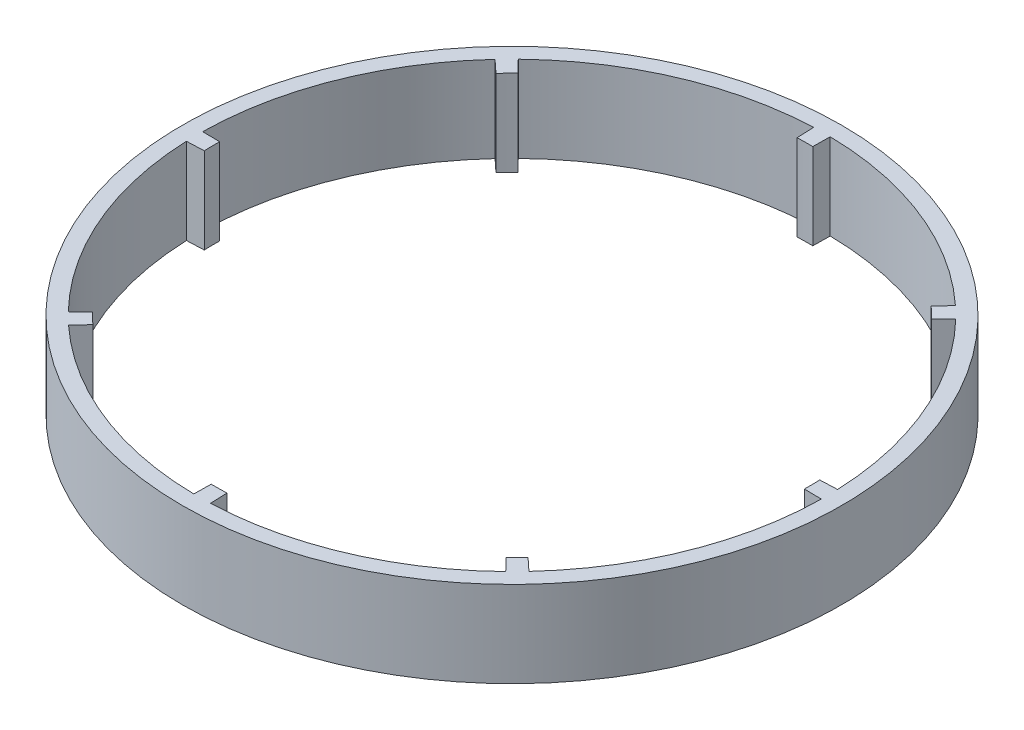
ISO-10303-21;
HEADER;
FILE_DESCRIPTION(('STEP AP214'),'2;1');
FILE_NAME('part.step','',(''),(''),'','','');
FILE_SCHEMA(('AUTOMOTIVE_DESIGN { 1 0 10303 214 1 1 1 1 }'));
ENDSEC;
DATA;
#1=APPLICATION_CONTEXT('core data for automotive mechanical design processes');
#2=APPLICATION_PROTOCOL_DEFINITION('international standard','automotive_design',2000,#1);
#3=PRODUCT_CONTEXT('',#1,'mechanical');
#4=PRODUCT('Part','Part','',(#3));
#5=PRODUCT_RELATED_PRODUCT_CATEGORY('part','',(#4));
#6=PRODUCT_DEFINITION_FORMATION('','',#4);
#7=PRODUCT_DEFINITION_CONTEXT('part definition',#1,'design');
#8=PRODUCT_DEFINITION('design','',#6,#7);
#9=PRODUCT_DEFINITION_SHAPE('','',#8);
#10=(LENGTH_UNIT() NAMED_UNIT(*) SI_UNIT(.MILLI.,.METRE.));
#11=(NAMED_UNIT(*) PLANE_ANGLE_UNIT() SI_UNIT($,.RADIAN.));
#12=(NAMED_UNIT(*) SI_UNIT($,.STERADIAN.) SOLID_ANGLE_UNIT());
#13=UNCERTAINTY_MEASURE_WITH_UNIT(LENGTH_MEASURE(1.E-05),#10,'distance_accuracy_value','');
#14=(GEOMETRIC_REPRESENTATION_CONTEXT(3) GLOBAL_UNCERTAINTY_ASSIGNED_CONTEXT((#13)) GLOBAL_UNIT_ASSIGNED_CONTEXT((#10,
#11,#12)) REPRESENTATION_CONTEXT('',''));
#15=CARTESIAN_POINT('',(0.,0.,0.));
#16=DIRECTION('',(0.,0.,1.));
#17=DIRECTION('',(1.,0.,0.));
#18=AXIS2_PLACEMENT_3D('',#15,#16,#17);
#19=CARTESIAN_POINT('',(0.,30.,0.));
#20=DIRECTION('',(0.,-1.,0.));
#21=DIRECTION('',(0.,0.,-1.));
#22=AXIS2_PLACEMENT_3D('',#19,#20,#21);
#23=CYLINDRICAL_SURFACE('',#22,103.5);
#24=CARTESIAN_POINT('',(0.,0.,0.));
#25=DIRECTION('',(0.,1.,0.));
#26=DIRECTION('',(0.,0.,1.));
#27=AXIS2_PLACEMENT_3D('',#24,#25,#26);
#28=CIRCLE('',#27,103.5);
#29=CARTESIAN_POINT('',(72.1436056941333,0.,74.2128705646769));
#30=VERTEX_POINT('',#29);
#31=CARTESIAN_POINT('',(75.9287369363859,0.,70.3354598139883));
#32=VERTEX_POINT('',#31);
#33=EDGE_CURVE('E296',#30,#32,#28,.T.);
#34=ORIENTED_EDGE('',*,*,#33,.F.);
#35=DIRECTION('',(0.,-1.,0.));
#36=VECTOR('',#35,1.);
#37=CARTESIAN_POINT('',(72.1436056941333,30.,74.2128705646769));
#38=LINE('',#37,#36);
#39=CARTESIAN_POINT('',(72.1436056941333,30.,74.2128705646769));
#40=VERTEX_POINT('',#39);
#41=EDGE_CURVE('E11',#40,#30,#38,.T.);
#42=ORIENTED_EDGE('',*,*,#41,.F.);
#43=CARTESIAN_POINT('',(0.,30.,0.));
#44=DIRECTION('',(0.,1.,0.));
#45=DIRECTION('',(0.,0.,1.));
#46=AXIS2_PLACEMENT_3D('',#43,#44,#45);
#47=CIRCLE('',#46,103.5);
#48=CARTESIAN_POINT('',(75.9287369363859,30.,70.3354598139883));
#49=VERTEX_POINT('',#48);
#50=EDGE_CURVE('E403',#40,#49,#47,.T.);
#51=ORIENTED_EDGE('',*,*,#50,.T.);
#52=DIRECTION('',(0.,-1.,0.));
#53=VECTOR('',#52,1.);
#54=CARTESIAN_POINT('',(75.9287369363859,30.,70.3354598139883));
#55=LINE('',#54,#53);
#56=EDGE_CURVE('E65',#49,#32,#55,.T.);
#57=ORIENTED_EDGE('',*,*,#56,.T.);
#58=EDGE_LOOP('',(#34,#42,#51,#57));
#59=FACE_BOUND('',#58,.T.);
#60=ADVANCED_FACE('F47',(#59),#23,.F.);
#61=CARTESIAN_POINT('',(6.25906942823322E-12,30.,-6.08454885799164E-12));
#62=DIRECTION('',(0.717032565842345,0.,-0.697039668542288));
#63=DIRECTION('',(-0.697039668542288,0.,-0.717032565842345));
#64=AXIS2_PLACEMENT_3D('',#61,#62,#63);
#65=PLANE('',#64);
#66=DIRECTION('',(0.697039668542288,0.,0.717032565842345));
#67=VECTOR('',#66,1.);
#68=CARTESIAN_POINT('',(6.25906942823322E-12,0.,-6.08454885799164E-12));
#69=LINE('',#68,#67);
#70=CARTESIAN_POINT('',(76.325843705387,0.,78.515065959731));
#71=VERTEX_POINT('',#70);
#72=EDGE_CURVE('E299',#30,#71,#69,.T.);
#73=ORIENTED_EDGE('',*,*,#72,.T.);
#74=DIRECTION('',(0.,-1.,0.));
#75=VECTOR('',#74,1.);
#76=CARTESIAN_POINT('',(76.325843705387,30.,78.515065959731));
#77=LINE('',#76,#75);
#78=CARTESIAN_POINT('',(76.325843705387,30.,78.515065959731));
#79=VERTEX_POINT('',#78);
#80=EDGE_CURVE('E57',#79,#71,#77,.T.);
#81=ORIENTED_EDGE('',*,*,#80,.F.);
#82=DIRECTION('',(0.697039668542288,0.,0.717032565842345));
#83=VECTOR('',#82,1.);
#84=CARTESIAN_POINT('',(6.25906942823322E-12,30.,-6.08454885799164E-12));
#85=LINE('',#84,#83);
#86=EDGE_CURVE('E511',#40,#79,#85,.T.);
#87=ORIENTED_EDGE('',*,*,#86,.F.);
#88=ORIENTED_EDGE('',*,*,#41,.T.);
#89=EDGE_LOOP('',(#73,#81,#87,#88));
#90=FACE_BOUND('',#89,.T.);
#91=ADVANCED_FACE('F49',(#90),#65,.F.);
#92=CARTESIAN_POINT('',(0.,30.,0.));
#93=DIRECTION('',(0.,-1.,0.));
#94=DIRECTION('',(0.,0.,-1.));
#95=AXIS2_PLACEMENT_3D('',#92,#93,#94);
#96=CYLINDRICAL_SURFACE('',#95,109.5);
#97=CARTESIAN_POINT('',(0.,0.,0.));
#98=DIRECTION('',(0.,1.,0.));
#99=DIRECTION('',(0.,0.,1.));
#100=AXIS2_PLACEMENT_3D('',#97,#98,#99);
#101=CIRCLE('',#100,109.5);
#102=CARTESIAN_POINT('',(4.18432210591433,0.,109.420023069427));
#103=VERTEX_POINT('',#102);
#104=EDGE_CURVE('E305',#103,#71,#101,.T.);
#105=ORIENTED_EDGE('',*,*,#104,.F.);
#106=DIRECTION('',(0.,-1.,0.));
#107=VECTOR('',#106,1.);
#108=CARTESIAN_POINT('',(4.18432210591433,30.,109.420023069427));
#109=LINE('',#108,#107);
#110=CARTESIAN_POINT('',(4.18432210591433,30.,109.420023069427));
#111=VERTEX_POINT('',#110);
#112=EDGE_CURVE('E485',#111,#103,#109,.T.);
#113=ORIENTED_EDGE('',*,*,#112,.F.);
#114=CARTESIAN_POINT('',(0.,30.,0.));
#115=DIRECTION('',(0.,1.,0.));
#116=DIRECTION('',(0.,0.,1.));
#117=AXIS2_PLACEMENT_3D('',#114,#115,#116);
#118=CIRCLE('',#117,109.5);
#119=EDGE_CURVE('E494',#111,#79,#118,.T.);
#120=ORIENTED_EDGE('',*,*,#119,.T.);
#121=ORIENTED_EDGE('',*,*,#80,.T.);
#122=EDGE_LOOP('',(#105,#113,#120,#121));
#123=FACE_BOUND('',#122,.T.);
#124=ADVANCED_FACE('F492',(#123),#96,.F.);
#125=CARTESIAN_POINT('',(8.88396437577493E-12,30.,-3.39730951272463E-13));
#126=DIRECTION('',(0.999269617072397,0.,-0.0382129872685428));
#127=DIRECTION('',(-0.0382129872685428,0.,-0.999269617072397));
#128=AXIS2_PLACEMENT_3D('',#125,#126,#127);
#129=PLANE('',#128);
#130=DIRECTION('',(0.0382129872685428,0.,0.999269617072397));
#131=VECTOR('',#130,1.);
#132=CARTESIAN_POINT('',(8.88396437577493E-12,0.,-3.39730951272463E-13));
#133=LINE('',#132,#131);
#134=CARTESIAN_POINT('',(3.95504418230307,0.,103.424405366993));
#135=VERTEX_POINT('',#134);
#136=EDGE_CURVE('E309',#135,#103,#133,.T.);
#137=ORIENTED_EDGE('',*,*,#136,.F.);
#138=DIRECTION('',(0.,-1.,0.));
#139=VECTOR('',#138,1.);
#140=CARTESIAN_POINT('',(3.95504418230307,30.,103.424405366993));
#141=LINE('',#140,#139);
#142=CARTESIAN_POINT('',(3.95504418230307,30.,103.424405366993));
#143=VERTEX_POINT('',#142);
#144=EDGE_CURVE('E482',#143,#135,#141,.T.);
#145=ORIENTED_EDGE('',*,*,#144,.F.);
#146=DIRECTION('',(0.0382129872685428,0.,0.999269617072397));
#147=VECTOR('',#146,1.);
#148=CARTESIAN_POINT('',(8.88396437577493E-12,30.,-3.39730951272463E-13));
#149=LINE('',#148,#147);
#150=EDGE_CURVE('E508',#143,#111,#149,.T.);
#151=ORIENTED_EDGE('',*,*,#150,.T.);
#152=ORIENTED_EDGE('',*,*,#112,.T.);
#153=EDGE_LOOP('',(#137,#145,#151,#152));
#154=FACE_BOUND('',#153,.T.);
#155=ADVANCED_FACE('F505',(#154),#129,.T.);
#156=CARTESIAN_POINT('',(-1.46319122203231,0.,103.489656833173));
#157=VERTEX_POINT('',#156);
#158=EDGE_CURVE('E301',#157,#135,#28,.T.);
#159=ORIENTED_EDGE('',*,*,#158,.F.);
#160=DIRECTION('',(0.,-1.,0.));
#161=VECTOR('',#160,1.);
#162=CARTESIAN_POINT('',(-1.46319122203231,30.,103.489656833173));
#163=LINE('',#162,#161);
#164=CARTESIAN_POINT('',(-1.46319122203231,30.,103.489656833173));
#165=VERTEX_POINT('',#164);
#166=EDGE_CURVE('E479',#165,#157,#163,.T.);
#167=ORIENTED_EDGE('',*,*,#166,.F.);
#168=EDGE_CURVE('E516',#165,#143,#47,.T.);
#169=ORIENTED_EDGE('',*,*,#168,.T.);
#170=ORIENTED_EDGE('',*,*,#144,.T.);
#171=EDGE_LOOP('',(#159,#167,#169,#170));
#172=FACE_BOUND('',#171,.T.);
#173=ADVANCED_FACE('F670',(#172),#23,.F.);
#174=CARTESIAN_POINT('',(8.90409621279607E-12,30.,1.25890797374811E-13));
#175=DIRECTION('',(0.999900066020987,0.,0.0141371132564369));
#176=DIRECTION('',(0.0141371132564369,0.,-0.999900066020987));
#177=AXIS2_PLACEMENT_3D('',#174,#175,#176);
#178=PLANE('',#177);
#179=DIRECTION('',(-0.0141371132564369,0.,0.999900066020987));
#180=VECTOR('',#179,1.);
#181=CARTESIAN_POINT('',(8.90409621279607E-12,0.,1.25890797374811E-13));
#182=LINE('',#181,#180);
#183=CARTESIAN_POINT('',(-1.54801390157094,0.,109.489057229299));
#184=VERTEX_POINT('',#183);
#185=EDGE_CURVE('E313',#157,#184,#182,.T.);
#186=ORIENTED_EDGE('',*,*,#185,.T.);
#187=DIRECTION('',(0.,-1.,0.));
#188=VECTOR('',#187,1.);
#189=CARTESIAN_POINT('',(-1.54801390157094,30.,109.489057229299));
#190=LINE('',#189,#188);
#191=CARTESIAN_POINT('',(-1.54801390157094,30.,109.489057229299));
#192=VERTEX_POINT('',#191);
#193=EDGE_CURVE('E476',#192,#184,#190,.T.);
#194=ORIENTED_EDGE('',*,*,#193,.F.);
#195=DIRECTION('',(-0.0141371132564369,0.,0.999900066020987));
#196=VECTOR('',#195,1.);
#197=CARTESIAN_POINT('',(8.90409621279607E-12,30.,1.25890797374811E-13));
#198=LINE('',#197,#196);
#199=EDGE_CURVE('E521',#165,#192,#198,.T.);
#200=ORIENTED_EDGE('',*,*,#199,.F.);
#201=ORIENTED_EDGE('',*,*,#166,.T.);
#202=EDGE_LOOP('',(#186,#194,#200,#201));
#203=FACE_BOUND('',#202,.T.);
#204=ADVANCED_FACE('F677',(#203),#178,.F.);
#205=CARTESIAN_POINT('',(0.,30.,0.));
#206=DIRECTION('',(0.,-1.,0.));
#207=DIRECTION('',(0.,0.,-1.));
#208=AXIS2_PLACEMENT_3D('',#205,#206,#207);
#209=CYLINDRICAL_SURFACE('',#208,109.5);
#210=CARTESIAN_POINT('',(0.,0.,0.));
#211=DIRECTION('',(0.,1.,0.));
#212=DIRECTION('',(0.,0.,1.));
#213=AXIS2_PLACEMENT_3D('',#210,#211,#212);
#214=CIRCLE('',#213,109.5);
#215=CARTESIAN_POINT('',(-74.4128777742197,0.,80.3304028457414));
#216=VERTEX_POINT('',#215);
#217=EDGE_CURVE('E317',#216,#184,#214,.T.);
#218=ORIENTED_EDGE('',*,*,#217,.F.);
#219=DIRECTION('',(0.,-1.,0.));
#220=VECTOR('',#219,1.);
#221=CARTESIAN_POINT('',(-74.4128777742197,30.,80.3304028457414));
#222=LINE('',#221,#220);
#223=CARTESIAN_POINT('',(-74.4128777742197,30.,80.3304028457414));
#224=VERTEX_POINT('',#223);
#225=EDGE_CURVE('E473',#224,#216,#222,.T.);
#226=ORIENTED_EDGE('',*,*,#225,.F.);
#227=CARTESIAN_POINT('',(0.,30.,0.));
#228=DIRECTION('',(0.,1.,0.));
#229=DIRECTION('',(0.,0.,1.));
#230=AXIS2_PLACEMENT_3D('',#227,#228,#229);
#231=CIRCLE('',#230,109.5);
#232=EDGE_CURVE('E524',#224,#192,#231,.T.);
#233=ORIENTED_EDGE('',*,*,#232,.T.);
#234=ORIENTED_EDGE('',*,*,#193,.T.);
#235=EDGE_LOOP('',(#218,#226,#233,#234));
#236=FACE_BOUND('',#235,.T.);
#237=ADVANCED_FACE('F895',(#236),#209,.F.);
#238=CARTESIAN_POINT('',(6.4903222084107E-12,30.,6.01221375843568E-12));
#239=DIRECTION('',(0.733610984892559,0.,0.679569660038594));
#240=DIRECTION('',(0.679569660038594,0.,-0.733610984892559));
#241=AXIS2_PLACEMENT_3D('',#238,#239,#240);
#242=PLANE('',#241);
#243=DIRECTION('',(-0.679569660038594,0.,0.733610984892559));
#244=VECTOR('',#243,1.);
#245=CARTESIAN_POINT('',(6.4903222084107E-12,0.,6.01221375843568E-12));
#246=LINE('',#245,#244);
#247=CARTESIAN_POINT('',(-70.3354598139881,0.,75.928736936386));
#248=VERTEX_POINT('',#247);
#249=EDGE_CURVE('E321',#248,#216,#246,.T.);
#250=ORIENTED_EDGE('',*,*,#249,.F.);
#251=DIRECTION('',(0.,-1.,0.));
#252=VECTOR('',#251,1.);
#253=CARTESIAN_POINT('',(-70.3354598139881,30.,75.928736936386));
#254=LINE('',#253,#252);
#255=CARTESIAN_POINT('',(-70.3354598139881,30.,75.928736936386));
#256=VERTEX_POINT('',#255);
#257=EDGE_CURVE('E470',#256,#248,#254,.T.);
#258=ORIENTED_EDGE('',*,*,#257,.F.);
#259=DIRECTION('',(-0.679569660038594,0.,0.733610984892559));
#260=VECTOR('',#259,1.);
#261=CARTESIAN_POINT('',(6.4903222084107E-12,30.,6.01221375843568E-12));
#262=LINE('',#261,#260);
#263=EDGE_CURVE('E528',#256,#224,#262,.T.);
#264=ORIENTED_EDGE('',*,*,#263,.T.);
#265=ORIENTED_EDGE('',*,*,#225,.T.);
#266=EDGE_LOOP('',(#250,#258,#264,#265));
#267=FACE_BOUND('',#266,.T.);
#268=ADVANCED_FACE('F888',(#267),#242,.T.);
#269=CARTESIAN_POINT('',(-74.2128705646766,0.,72.1436056941334));
#270=VERTEX_POINT('',#269);
#271=EDGE_CURVE('E325',#270,#248,#28,.T.);
#272=ORIENTED_EDGE('',*,*,#271,.F.);
#273=DIRECTION('',(0.,-1.,0.));
#274=VECTOR('',#273,1.);
#275=CARTESIAN_POINT('',(-74.2128705646766,30.,72.1436056941334));
#276=LINE('',#275,#274);
#277=CARTESIAN_POINT('',(-74.2128705646766,30.,72.1436056941334));
#278=VERTEX_POINT('',#277);
#279=EDGE_CURVE('E467',#278,#270,#276,.T.);
#280=ORIENTED_EDGE('',*,*,#279,.F.);
#281=EDGE_CURVE('E532',#278,#256,#47,.T.);
#282=ORIENTED_EDGE('',*,*,#281,.T.);
#283=ORIENTED_EDGE('',*,*,#257,.T.);
#284=EDGE_LOOP('',(#272,#280,#282,#283));
#285=FACE_BOUND('',#284,.T.);
#286=ADVANCED_FACE('F678',(#285),#23,.F.);
#287=CARTESIAN_POINT('',(6.48599365545847E-12,30.,6.67202869893543E-12));
#288=DIRECTION('',(0.697039668542286,0.,0.717032565842347));
#289=DIRECTION('',(0.717032565842347,0.,-0.697039668542286));
#290=AXIS2_PLACEMENT_3D('',#287,#288,#289);
#291=PLANE('',#290);
#292=DIRECTION('',(-0.717032565842347,0.,0.697039668542286));
#293=VECTOR('',#292,1.);
#294=CARTESIAN_POINT('',(6.48599365545847E-12,0.,6.67202869893543E-12));
#295=LINE('',#294,#293);
#296=CARTESIAN_POINT('',(-78.5150659597307,0.,76.3258437053871));
#297=VERTEX_POINT('',#296);
#298=EDGE_CURVE('E326',#270,#297,#295,.T.);
#299=ORIENTED_EDGE('',*,*,#298,.T.);
#300=DIRECTION('',(0.,-1.,0.));
#301=VECTOR('',#300,1.);
#302=CARTESIAN_POINT('',(-78.5150659597307,30.,76.3258437053871));
#303=LINE('',#302,#301);
#304=CARTESIAN_POINT('',(-78.5150659597307,30.,76.3258437053871));
#305=VERTEX_POINT('',#304);
#306=EDGE_CURVE('E464',#305,#297,#303,.T.);
#307=ORIENTED_EDGE('',*,*,#306,.F.);
#308=DIRECTION('',(-0.717032565842347,0.,0.697039668542286));
#309=VECTOR('',#308,1.);
#310=CARTESIAN_POINT('',(6.48599365545847E-12,30.,6.67202869893543E-12));
#311=LINE('',#310,#309);
#312=EDGE_CURVE('E533',#278,#305,#311,.T.);
#313=ORIENTED_EDGE('',*,*,#312,.F.);
#314=ORIENTED_EDGE('',*,*,#279,.T.);
#315=EDGE_LOOP('',(#299,#307,#313,#314));
#316=FACE_BOUND('',#315,.T.);
#317=ADVANCED_FACE('F871',(#316),#291,.F.);
#318=CARTESIAN_POINT('',(0.,30.,0.));
#319=DIRECTION('',(0.,-1.,0.));
#320=DIRECTION('',(0.,0.,-1.));
#321=AXIS2_PLACEMENT_3D('',#318,#319,#320);
#322=CYLINDRICAL_SURFACE('',#321,109.5);
#323=CARTESIAN_POINT('',(0.,0.,0.));
#324=DIRECTION('',(0.,1.,0.));
#325=DIRECTION('',(0.,0.,1.));
#326=AXIS2_PLACEMENT_3D('',#323,#324,#325);
#327=CIRCLE('',#326,109.5);
#328=CARTESIAN_POINT('',(-109.420023069427,0.,4.18432210591443));
#329=VERTEX_POINT('',#328);
#330=EDGE_CURVE('E330',#329,#297,#327,.T.);
#331=ORIENTED_EDGE('',*,*,#330,.F.);
#332=DIRECTION('',(0.,-1.,0.));
#333=VECTOR('',#332,1.);
#334=CARTESIAN_POINT('',(-109.420023069427,30.,4.18432210591443));
#335=LINE('',#334,#333);
#336=CARTESIAN_POINT('',(-109.420023069427,30.,4.18432210591443));
#337=VERTEX_POINT('',#336);
#338=EDGE_CURVE('E461',#337,#329,#335,.T.);
#339=ORIENTED_EDGE('',*,*,#338,.F.);
#340=CARTESIAN_POINT('',(0.,30.,0.));
#341=DIRECTION('',(0.,1.,0.));
#342=DIRECTION('',(0.,0.,1.));
#343=AXIS2_PLACEMENT_3D('',#340,#341,#342);
#344=CIRCLE('',#343,109.5);
#345=EDGE_CURVE('E536',#337,#305,#344,.T.);
#346=ORIENTED_EDGE('',*,*,#345,.T.);
#347=ORIENTED_EDGE('',*,*,#306,.T.);
#348=EDGE_LOOP('',(#331,#339,#346,#347));
#349=FACE_BOUND('',#348,.T.);
#350=ADVANCED_FACE('F862',(#349),#322,.F.);
#351=CARTESIAN_POINT('',(3.43277410958918E-13,30.,8.97670429657571E-12));
#352=DIRECTION('',(0.0382129872685429,0.,0.999269617072397));
#353=DIRECTION('',(0.999269617072397,0.,-0.0382129872685429));
#354=AXIS2_PLACEMENT_3D('',#351,#352,#353);
#355=PLANE('',#354);
#356=DIRECTION('',(-0.999269617072397,0.,0.0382129872685429));
#357=VECTOR('',#356,1.);
#358=CARTESIAN_POINT('',(3.43277410958918E-13,0.,8.97670429657571E-12));
#359=LINE('',#358,#357);
#360=CARTESIAN_POINT('',(-103.424405366993,0.,3.95504418230317));
#361=VERTEX_POINT('',#360);
#362=EDGE_CURVE('E334',#361,#329,#359,.T.);
#363=ORIENTED_EDGE('',*,*,#362,.F.);
#364=DIRECTION('',(0.,-1.,0.));
#365=VECTOR('',#364,1.);
#366=CARTESIAN_POINT('',(-103.424405366993,30.,3.95504418230317));
#367=LINE('',#366,#365);
#368=CARTESIAN_POINT('',(-103.424405366993,30.,3.95504418230317));
#369=VERTEX_POINT('',#368);
#370=EDGE_CURVE('E458',#369,#361,#367,.T.);
#371=ORIENTED_EDGE('',*,*,#370,.F.);
#372=DIRECTION('',(-0.999269617072397,0.,0.0382129872685429));
#373=VECTOR('',#372,1.);
#374=CARTESIAN_POINT('',(3.43277410958918E-13,30.,8.97670429657571E-12));
#375=LINE('',#374,#373);
#376=EDGE_CURVE('E540',#369,#337,#375,.T.);
#377=ORIENTED_EDGE('',*,*,#376,.T.);
#378=ORIENTED_EDGE('',*,*,#338,.T.);
#379=EDGE_LOOP('',(#363,#371,#377,#378));
#380=FACE_BOUND('',#379,.T.);
#381=ADVANCED_FACE('F855',(#380),#355,.T.);
#382=CARTESIAN_POINT('',(-103.489656833172,0.,-1.46319122203222));
#383=VERTEX_POINT('',#382);
#384=EDGE_CURVE('E338',#383,#361,#28,.T.);
#385=ORIENTED_EDGE('',*,*,#384,.F.);
#386=DIRECTION('',(0.,-1.,0.));
#387=VECTOR('',#386,1.);
#388=CARTESIAN_POINT('',(-103.489656833172,30.,-1.46319122203222));
#389=LINE('',#388,#387);
#390=CARTESIAN_POINT('',(-103.489656833172,30.,-1.46319122203222));
#391=VERTEX_POINT('',#390);
#392=EDGE_CURVE('E455',#391,#383,#389,.T.);
#393=ORIENTED_EDGE('',*,*,#392,.F.);
#394=EDGE_CURVE('E544',#391,#369,#47,.T.);
#395=ORIENTED_EDGE('',*,*,#394,.T.);
#396=ORIENTED_EDGE('',*,*,#370,.T.);
#397=EDGE_LOOP('',(#385,#393,#395,#396));
#398=FACE_BOUND('',#397,.T.);
#399=ADVANCED_FACE('F822',(#398),#23,.F.);
#400=CARTESIAN_POINT('',(-1.27141520469483E-13,30.,8.99255826882209E-12));
#401=DIRECTION('',(-0.0141371132564368,0.,0.999900066020987));
#402=DIRECTION('',(0.999900066020987,0.,0.0141371132564368));
#403=AXIS2_PLACEMENT_3D('',#400,#401,#402);
#404=PLANE('',#403);
#405=DIRECTION('',(-0.999900066020987,0.,-0.0141371132564368));
#406=VECTOR('',#405,1.);
#407=CARTESIAN_POINT('',(-1.27141520469483E-13,0.,8.99255826882209E-12));
#408=LINE('',#407,#406);
#409=CARTESIAN_POINT('',(-109.489057229298,0.,-1.54801390157084));
#410=VERTEX_POINT('',#409);
#411=EDGE_CURVE('E339',#383,#410,#408,.T.);
#412=ORIENTED_EDGE('',*,*,#411,.T.);
#413=DIRECTION('',(0.,-1.,0.));
#414=VECTOR('',#413,1.);
#415=CARTESIAN_POINT('',(-109.489057229298,30.,-1.54801390157084));
#416=LINE('',#415,#414);
#417=CARTESIAN_POINT('',(-109.489057229298,30.,-1.54801390157084));
#418=VERTEX_POINT('',#417);
#419=EDGE_CURVE('E452',#418,#410,#416,.T.);
#420=ORIENTED_EDGE('',*,*,#419,.F.);
#421=DIRECTION('',(-0.999900066020987,0.,-0.0141371132564368));
#422=VECTOR('',#421,1.);
#423=CARTESIAN_POINT('',(-1.27141520469483E-13,30.,8.99255826882209E-12));
#424=LINE('',#423,#422);
#425=EDGE_CURVE('E545',#391,#418,#424,.T.);
#426=ORIENTED_EDGE('',*,*,#425,.F.);
#427=ORIENTED_EDGE('',*,*,#392,.T.);
#428=EDGE_LOOP('',(#412,#420,#426,#427));
#429=FACE_BOUND('',#428,.T.);
#430=ADVANCED_FACE('F838',(#429),#404,.F.);
#431=CARTESIAN_POINT('',(0.,30.,0.));
#432=DIRECTION('',(0.,-1.,0.));
#433=DIRECTION('',(0.,0.,-1.));
#434=AXIS2_PLACEMENT_3D('',#431,#432,#433);
#435=CYLINDRICAL_SURFACE('',#434,109.5);
#436=CARTESIAN_POINT('',(0.,0.,0.));
#437=DIRECTION('',(0.,1.,0.));
#438=DIRECTION('',(0.,0.,1.));
#439=AXIS2_PLACEMENT_3D('',#436,#437,#438);
#440=CIRCLE('',#439,109.5);
#441=CARTESIAN_POINT('',(-80.3304028457412,0.,-74.4128777742196));
#442=VERTEX_POINT('',#441);
#443=EDGE_CURVE('E343',#442,#410,#440,.T.);
#444=ORIENTED_EDGE('',*,*,#443,.F.);
#445=DIRECTION('',(0.,-1.,0.));
#446=VECTOR('',#445,1.);
#447=CARTESIAN_POINT('',(-80.3304028457412,30.,-74.4128777742196));
#448=LINE('',#447,#446);
#449=CARTESIAN_POINT('',(-80.3304028457412,30.,-74.4128777742196));
#450=VERTEX_POINT('',#449);
#451=EDGE_CURVE('E449',#450,#442,#448,.T.);
#452=ORIENTED_EDGE('',*,*,#451,.F.);
#453=CARTESIAN_POINT('',(0.,30.,0.));
#454=DIRECTION('',(0.,1.,0.));
#455=DIRECTION('',(0.,0.,1.));
#456=AXIS2_PLACEMENT_3D('',#453,#454,#455);
#457=CIRCLE('',#456,109.5);
#458=EDGE_CURVE('E548',#450,#418,#457,.T.);
#459=ORIENTED_EDGE('',*,*,#458,.T.);
#460=ORIENTED_EDGE('',*,*,#419,.T.);
#461=EDGE_LOOP('',(#444,#452,#459,#460));
#462=FACE_BOUND('',#461,.T.);
#463=ADVANCED_FACE('F829',(#462),#435,.F.);
#464=CARTESIAN_POINT('',(-6.09237660854817E-12,30.,6.57685983785617E-12));
#465=DIRECTION('',(-0.679569660038595,0.,0.733610984892558));
#466=DIRECTION('',(0.733610984892558,0.,0.679569660038595));
#467=AXIS2_PLACEMENT_3D('',#464,#465,#466);
#468=PLANE('',#467);
#469=DIRECTION('',(-0.733610984892558,0.,-0.679569660038595));
#470=VECTOR('',#469,1.);
#471=CARTESIAN_POINT('',(-6.09237660854817E-12,0.,6.57685983785617E-12));
#472=LINE('',#471,#470);
#473=CARTESIAN_POINT('',(-75.9287369363858,0.,-70.335459813988));
#474=VERTEX_POINT('',#473);
#475=EDGE_CURVE('E347',#474,#442,#472,.T.);
#476=ORIENTED_EDGE('',*,*,#475,.F.);
#477=DIRECTION('',(0.,-1.,0.));
#478=VECTOR('',#477,1.);
#479=CARTESIAN_POINT('',(-75.9287369363858,30.,-70.335459813988));
#480=LINE('',#479,#478);
#481=CARTESIAN_POINT('',(-75.9287369363858,30.,-70.335459813988));
#482=VERTEX_POINT('',#481);
#483=EDGE_CURVE('E446',#482,#474,#480,.T.);
#484=ORIENTED_EDGE('',*,*,#483,.F.);
#485=DIRECTION('',(-0.733610984892558,0.,-0.679569660038595));
#486=VECTOR('',#485,1.);
#487=CARTESIAN_POINT('',(-6.09237660854817E-12,30.,6.57685983785617E-12));
#488=LINE('',#487,#486);
#489=EDGE_CURVE('E552',#482,#450,#488,.T.);
#490=ORIENTED_EDGE('',*,*,#489,.T.);
#491=ORIENTED_EDGE('',*,*,#451,.T.);
#492=EDGE_LOOP('',(#476,#484,#490,#491));
#493=FACE_BOUND('',#492,.T.);
#494=ADVANCED_FACE('F821',(#493),#468,.T.);
#495=CARTESIAN_POINT('',(-72.1436056941332,0.,-74.2128705646765));
#496=VERTEX_POINT('',#495);
#497=EDGE_CURVE('E351',#496,#474,#28,.T.);
#498=ORIENTED_EDGE('',*,*,#497,.F.);
#499=DIRECTION('',(0.,-1.,0.));
#500=VECTOR('',#499,1.);
#501=CARTESIAN_POINT('',(-72.1436056941332,30.,-74.2128705646765));
#502=LINE('',#501,#500);
#503=CARTESIAN_POINT('',(-72.1436056941332,30.,-74.2128705646765));
#504=VERTEX_POINT('',#503);
#505=EDGE_CURVE('E443',#504,#496,#502,.T.);
#506=ORIENTED_EDGE('',*,*,#505,.F.);
#507=EDGE_CURVE('E556',#504,#482,#47,.T.);
#508=ORIENTED_EDGE('',*,*,#507,.T.);
#509=ORIENTED_EDGE('',*,*,#483,.T.);
#510=EDGE_LOOP('',(#498,#506,#508,#509));
#511=FACE_BOUND('',#510,.T.);
#512=ADVANCED_FACE('F667',(#511),#23,.F.);
#513=CARTESIAN_POINT('',(-6.48793842163445E-12,30.,6.30703633610578E-12));
#514=DIRECTION('',(-0.717032565842346,0.,0.697039668542287));
#515=DIRECTION('',(0.697039668542287,0.,0.717032565842346));
#516=AXIS2_PLACEMENT_3D('',#513,#514,#515);
#517=PLANE('',#516);
#518=DIRECTION('',(-0.697039668542287,0.,-0.717032565842346));
#519=VECTOR('',#518,1.);
#520=CARTESIAN_POINT('',(-6.48793842163445E-12,0.,6.30703633610578E-12));
#521=LINE('',#520,#519);
#522=CARTESIAN_POINT('',(-76.3258437053869,0.,-78.5150659597306));
#523=VERTEX_POINT('',#522);
#524=EDGE_CURVE('E352',#496,#523,#521,.T.);
#525=ORIENTED_EDGE('',*,*,#524,.T.);
#526=DIRECTION('',(0.,-1.,0.));
#527=VECTOR('',#526,1.);
#528=CARTESIAN_POINT('',(-76.3258437053869,30.,-78.5150659597306));
#529=LINE('',#528,#527);
#530=CARTESIAN_POINT('',(-76.3258437053869,30.,-78.5150659597306));
#531=VERTEX_POINT('',#530);
#532=EDGE_CURVE('E440',#531,#523,#529,.T.);
#533=ORIENTED_EDGE('',*,*,#532,.F.);
#534=DIRECTION('',(-0.697039668542287,0.,-0.717032565842346));
#535=VECTOR('',#534,1.);
#536=CARTESIAN_POINT('',(-6.48793842163445E-12,30.,6.30703633610578E-12));
#537=LINE('',#536,#535);
#538=EDGE_CURVE('E557',#504,#531,#537,.T.);
#539=ORIENTED_EDGE('',*,*,#538,.F.);
#540=ORIENTED_EDGE('',*,*,#505,.T.);
#541=EDGE_LOOP('',(#525,#533,#539,#540));
#542=FACE_BOUND('',#541,.T.);
#543=ADVANCED_FACE('F804',(#542),#517,.F.);
#544=CARTESIAN_POINT('',(0.,30.,0.));
#545=DIRECTION('',(0.,-1.,0.));
#546=DIRECTION('',(0.,0.,-1.));
#547=AXIS2_PLACEMENT_3D('',#544,#545,#546);
#548=CYLINDRICAL_SURFACE('',#547,109.5);
#549=CARTESIAN_POINT('',(0.,0.,0.));
#550=DIRECTION('',(0.,1.,0.));
#551=DIRECTION('',(0.,0.,1.));
#552=AXIS2_PLACEMENT_3D('',#549,#550,#551);
#553=CIRCLE('',#552,109.5);
#554=CARTESIAN_POINT('',(-4.18432210591418,0.,-109.420023069427));
#555=VERTEX_POINT('',#554);
#556=EDGE_CURVE('E356',#555,#523,#553,.T.);
#557=ORIENTED_EDGE('',*,*,#556,.F.);
#558=DIRECTION('',(0.,-1.,0.));
#559=VECTOR('',#558,1.);
#560=CARTESIAN_POINT('',(-4.18432210591418,30.,-109.420023069427));
#561=LINE('',#560,#559);
#562=CARTESIAN_POINT('',(-4.18432210591418,30.,-109.420023069427));
#563=VERTEX_POINT('',#562);
#564=EDGE_CURVE('E437',#563,#555,#561,.T.);
#565=ORIENTED_EDGE('',*,*,#564,.F.);
#566=CARTESIAN_POINT('',(0.,30.,0.));
#567=DIRECTION('',(0.,1.,0.));
#568=DIRECTION('',(0.,0.,1.));
#569=AXIS2_PLACEMENT_3D('',#566,#567,#568);
#570=CIRCLE('',#569,109.5);
#571=EDGE_CURVE('E560',#563,#531,#570,.T.);
#572=ORIENTED_EDGE('',*,*,#571,.T.);
#573=ORIENTED_EDGE('',*,*,#532,.T.);
#574=EDGE_LOOP('',(#557,#565,#572,#573));
#575=FACE_BOUND('',#574,.T.);
#576=ADVANCED_FACE('F797',(#575),#548,.F.);
#577=CARTESIAN_POINT('',(-8.74615458692145E-12,30.,3.34460978467359E-13));
#578=DIRECTION('',(-0.999269617072397,0.,0.0382129872685428));
#579=DIRECTION('',(0.0382129872685428,0.,0.999269617072397));
#580=AXIS2_PLACEMENT_3D('',#577,#578,#579);
#581=PLANE('',#580);
#582=DIRECTION('',(-0.0382129872685428,0.,-0.999269617072397));
#583=VECTOR('',#582,1.);
#584=CARTESIAN_POINT('',(-8.74615458692145E-12,0.,3.34460978467359E-13));
#585=LINE('',#584,#583);
#586=CARTESIAN_POINT('',(-3.95504418230292,0.,-103.424405366993));
#587=VERTEX_POINT('',#586);
#588=EDGE_CURVE('E360',#587,#555,#585,.T.);
#589=ORIENTED_EDGE('',*,*,#588,.F.);
#590=DIRECTION('',(0.,-1.,0.));
#591=VECTOR('',#590,1.);
#592=CARTESIAN_POINT('',(-3.95504418230292,30.,-103.424405366993));
#593=LINE('',#592,#591);
#594=CARTESIAN_POINT('',(-3.95504418230292,30.,-103.424405366993));
#595=VERTEX_POINT('',#594);
#596=EDGE_CURVE('E434',#595,#587,#593,.T.);
#597=ORIENTED_EDGE('',*,*,#596,.F.);
#598=DIRECTION('',(-0.0382129872685428,0.,-0.999269617072397));
#599=VECTOR('',#598,1.);
#600=CARTESIAN_POINT('',(-8.74615458692145E-12,30.,3.34460978467359E-13));
#601=LINE('',#600,#599);
#602=EDGE_CURVE('E564',#595,#563,#601,.T.);
#603=ORIENTED_EDGE('',*,*,#602,.T.);
#604=ORIENTED_EDGE('',*,*,#564,.T.);
#605=EDGE_LOOP('',(#589,#597,#603,#604));
#606=FACE_BOUND('',#605,.T.);
#607=ADVANCED_FACE('F623',(#606),#581,.T.);
#608=CARTESIAN_POINT('',(1.46319122203246,0.,-103.489656833172));
#609=VERTEX_POINT('',#608);
#610=EDGE_CURVE('E364',#609,#587,#28,.T.);
#611=ORIENTED_EDGE('',*,*,#610,.F.);
#612=DIRECTION('',(0.,-1.,0.));
#613=VECTOR('',#612,1.);
#614=CARTESIAN_POINT('',(1.46319122203246,30.,-103.489656833172));
#615=LINE('',#614,#613);
#616=CARTESIAN_POINT('',(1.46319122203246,30.,-103.489656833172));
#617=VERTEX_POINT('',#616);
#618=EDGE_CURVE('E431',#617,#609,#615,.T.);
#619=ORIENTED_EDGE('',*,*,#618,.F.);
#620=EDGE_CURVE('E568',#617,#595,#47,.T.);
#621=ORIENTED_EDGE('',*,*,#620,.T.);
#622=ORIENTED_EDGE('',*,*,#596,.T.);
#623=EDGE_LOOP('',(#611,#619,#621,#622));
#624=FACE_BOUND('',#623,.T.);
#625=ADVANCED_FACE('F615',(#624),#23,.F.);
#626=CARTESIAN_POINT('',(-8.757309909047E-12,30.,-1.23815455377034E-13));
#627=DIRECTION('',(-0.999900066020987,0.,-0.0141371132564369));
#628=DIRECTION('',(-0.0141371132564369,0.,0.999900066020987));
#629=AXIS2_PLACEMENT_3D('',#626,#627,#628);
#630=PLANE('',#629);
#631=DIRECTION('',(0.0141371132564369,0.,-0.999900066020987));
#632=VECTOR('',#631,1.);
#633=CARTESIAN_POINT('',(-8.757309909047E-12,0.,-1.23815455377034E-13));
#634=LINE('',#633,#632);
#635=CARTESIAN_POINT('',(1.54801390157109,0.,-109.489057229298));
#636=VERTEX_POINT('',#635);
#637=EDGE_CURVE('E365',#609,#636,#634,.T.);
#638=ORIENTED_EDGE('',*,*,#637,.T.);
#639=DIRECTION('',(0.,-1.,0.));
#640=VECTOR('',#639,1.);
#641=CARTESIAN_POINT('',(1.54801390157109,30.,-109.489057229298));
#642=LINE('',#641,#640);
#643=CARTESIAN_POINT('',(1.54801390157109,30.,-109.489057229298));
#644=VERTEX_POINT('',#643);
#645=EDGE_CURVE('E428',#644,#636,#642,.T.);
#646=ORIENTED_EDGE('',*,*,#645,.F.);
#647=DIRECTION('',(0.0141371132564369,0.,-0.999900066020987));
#648=VECTOR('',#647,1.);
#649=CARTESIAN_POINT('',(-8.757309909047E-12,30.,-1.23815455377034E-13));
#650=LINE('',#649,#648);
#651=EDGE_CURVE('E569',#617,#644,#650,.T.);
#652=ORIENTED_EDGE('',*,*,#651,.F.);
#653=ORIENTED_EDGE('',*,*,#618,.T.);
#654=EDGE_LOOP('',(#638,#646,#652,#653));
#655=FACE_BOUND('',#654,.T.);
#656=ADVANCED_FACE('F658',(#655),#630,.F.);
#657=CARTESIAN_POINT('',(0.,30.,0.));
#658=DIRECTION('',(0.,-1.,0.));
#659=DIRECTION('',(0.,0.,-1.));
#660=AXIS2_PLACEMENT_3D('',#657,#658,#659);
#661=CYLINDRICAL_SURFACE('',#660,109.5);
#662=CARTESIAN_POINT('',(0.,0.,0.));
#663=DIRECTION('',(0.,1.,0.));
#664=DIRECTION('',(0.,0.,1.));
#665=AXIS2_PLACEMENT_3D('',#662,#663,#664);
#666=CIRCLE('',#665,109.5);
#667=CARTESIAN_POINT('',(74.4128777742198,0.,-80.3304028457411));
#668=VERTEX_POINT('',#667);
#669=EDGE_CURVE('E369',#668,#636,#666,.T.);
#670=ORIENTED_EDGE('',*,*,#669,.F.);
#671=DIRECTION('',(0.,-1.,0.));
#672=VECTOR('',#671,1.);
#673=CARTESIAN_POINT('',(74.4128777742198,30.,-80.3304028457411));
#674=LINE('',#673,#672);
#675=CARTESIAN_POINT('',(74.4128777742198,30.,-80.3304028457411));
#676=VERTEX_POINT('',#675);
#677=EDGE_CURVE('E425',#676,#668,#674,.T.);
#678=ORIENTED_EDGE('',*,*,#677,.F.);
#679=CARTESIAN_POINT('',(0.,30.,0.));
#680=DIRECTION('',(0.,1.,0.));
#681=DIRECTION('',(0.,0.,1.));
#682=AXIS2_PLACEMENT_3D('',#679,#680,#681);
#683=CIRCLE('',#682,109.5);
#684=EDGE_CURVE('E572',#676,#644,#683,.T.);
#685=ORIENTED_EDGE('',*,*,#684,.T.);
#686=ORIENTED_EDGE('',*,*,#645,.T.);
#687=EDGE_LOOP('',(#670,#678,#685,#686));
#688=FACE_BOUND('',#687,.T.);
#689=ADVANCED_FACE('F656',(#688),#661,.F.);
#690=CARTESIAN_POINT('',(-6.35797053984703E-12,30.,-5.88961175238132E-12));
#691=DIRECTION('',(-0.733610984892558,0.,-0.679569660038595));
#692=DIRECTION('',(-0.679569660038595,0.,0.733610984892558));
#693=AXIS2_PLACEMENT_3D('',#690,#691,#692);
#694=PLANE('',#693);
#695=DIRECTION('',(0.679569660038595,0.,-0.733610984892558));
#696=VECTOR('',#695,1.);
#697=CARTESIAN_POINT('',(-6.35797053984703E-12,0.,-5.88961175238132E-12));
#698=LINE('',#697,#696);
#699=CARTESIAN_POINT('',(70.3354598139883,0.,-75.9287369363857));
#700=VERTEX_POINT('',#699);
#701=EDGE_CURVE('E373',#700,#668,#698,.T.);
#702=ORIENTED_EDGE('',*,*,#701,.F.);
#703=DIRECTION('',(0.,-1.,0.));
#704=VECTOR('',#703,1.);
#705=CARTESIAN_POINT('',(70.3354598139883,30.,-75.9287369363857));
#706=LINE('',#705,#704);
#707=CARTESIAN_POINT('',(70.3354598139883,30.,-75.9287369363857));
#708=VERTEX_POINT('',#707);
#709=EDGE_CURVE('E422',#708,#700,#706,.T.);
#710=ORIENTED_EDGE('',*,*,#709,.F.);
#711=DIRECTION('',(0.679569660038595,0.,-0.733610984892558));
#712=VECTOR('',#711,1.);
#713=CARTESIAN_POINT('',(-6.35797053984703E-12,30.,-5.88961175238132E-12));
#714=LINE('',#713,#712);
#715=EDGE_CURVE('E576',#708,#676,#714,.T.);
#716=ORIENTED_EDGE('',*,*,#715,.T.);
#717=ORIENTED_EDGE('',*,*,#677,.T.);
#718=EDGE_LOOP('',(#702,#710,#716,#717));
#719=FACE_BOUND('',#718,.T.);
#720=ADVANCED_FACE('F653',(#719),#694,.T.);
#721=CARTESIAN_POINT('',(74.2128705646768,0.,-72.1436056941331));
#722=VERTEX_POINT('',#721);
#723=EDGE_CURVE('E377',#722,#700,#28,.T.);
#724=ORIENTED_EDGE('',*,*,#723,.F.);
#725=DIRECTION('',(0.,-1.,0.));
#726=VECTOR('',#725,1.);
#727=CARTESIAN_POINT('',(74.2128705646768,30.,-72.1436056941331));
#728=LINE('',#727,#726);
#729=CARTESIAN_POINT('',(74.2128705646768,30.,-72.1436056941331));
#730=VERTEX_POINT('',#729);
#731=EDGE_CURVE('E419',#730,#722,#728,.T.);
#732=ORIENTED_EDGE('',*,*,#731,.F.);
#733=EDGE_CURVE('E580',#730,#708,#47,.T.);
#734=ORIENTED_EDGE('',*,*,#733,.T.);
#735=ORIENTED_EDGE('',*,*,#709,.T.);
#736=EDGE_LOOP('',(#724,#732,#734,#735));
#737=FACE_BOUND('',#736,.T.);
#738=ADVANCED_FACE('F647',(#737),#23,.F.);
#739=CARTESIAN_POINT('',(-6.13775238536675E-12,30.,-6.31379897013352E-12));
#740=DIRECTION('',(-0.697039668542287,0.,-0.717032565842346));
#741=DIRECTION('',(-0.717032565842346,0.,0.697039668542287));
#742=AXIS2_PLACEMENT_3D('',#739,#740,#741);
#743=PLANE('',#742);
#744=DIRECTION('',(0.717032565842346,0.,-0.697039668542287));
#745=VECTOR('',#744,1.);
#746=CARTESIAN_POINT('',(-6.13775238536675E-12,0.,-6.31379897013352E-12));
#747=LINE('',#746,#745);
#748=CARTESIAN_POINT('',(78.5150659597309,0.,-76.3258437053868));
#749=VERTEX_POINT('',#748);
#750=EDGE_CURVE('E378',#722,#749,#747,.T.);
#751=ORIENTED_EDGE('',*,*,#750,.T.);
#752=DIRECTION('',(0.,-1.,0.));
#753=VECTOR('',#752,1.);
#754=CARTESIAN_POINT('',(78.5150659597309,30.,-76.3258437053868));
#755=LINE('',#754,#753);
#756=CARTESIAN_POINT('',(78.5150659597309,30.,-76.3258437053868));
#757=VERTEX_POINT('',#756);
#758=EDGE_CURVE('E416',#757,#749,#755,.T.);
#759=ORIENTED_EDGE('',*,*,#758,.F.);
#760=DIRECTION('',(0.717032565842346,0.,-0.697039668542287));
#761=VECTOR('',#760,1.);
#762=CARTESIAN_POINT('',(-6.13775238536675E-12,30.,-6.31379897013352E-12));
#763=LINE('',#762,#761);
#764=EDGE_CURVE('E581',#730,#757,#763,.T.);
#765=ORIENTED_EDGE('',*,*,#764,.F.);
#766=ORIENTED_EDGE('',*,*,#731,.T.);
#767=EDGE_LOOP('',(#751,#759,#765,#766));
#768=FACE_BOUND('',#767,.T.);
#769=ADVANCED_FACE('F685',(#768),#743,.F.);
#770=CARTESIAN_POINT('',(0.,30.,0.));
#771=DIRECTION('',(0.,-1.,0.));
#772=DIRECTION('',(0.,0.,-1.));
#773=AXIS2_PLACEMENT_3D('',#770,#771,#772);
#774=CYLINDRICAL_SURFACE('',#773,109.5);
#775=CARTESIAN_POINT('',(0.,0.,0.));
#776=DIRECTION('',(0.,1.,0.));
#777=DIRECTION('',(0.,0.,1.));
#778=AXIS2_PLACEMENT_3D('',#775,#776,#777);
#779=CIRCLE('',#778,109.5);
#780=CARTESIAN_POINT('',(109.420023069427,0.,-4.1843221059141));
#781=VERTEX_POINT('',#780);
#782=EDGE_CURVE('E382',#781,#749,#779,.T.);
#783=ORIENTED_EDGE('',*,*,#782,.F.);
#784=DIRECTION('',(0.,-1.,0.));
#785=VECTOR('',#784,1.);
#786=CARTESIAN_POINT('',(109.420023069427,30.,-4.1843221059141));
#787=LINE('',#786,#785);
#788=CARTESIAN_POINT('',(109.420023069427,30.,-4.1843221059141));
#789=VERTEX_POINT('',#788);
#790=EDGE_CURVE('E413',#789,#781,#787,.T.);
#791=ORIENTED_EDGE('',*,*,#790,.F.);
#792=CARTESIAN_POINT('',(0.,30.,0.));
#793=DIRECTION('',(0.,1.,0.));
#794=DIRECTION('',(0.,0.,1.));
#795=AXIS2_PLACEMENT_3D('',#792,#793,#794);
#796=CIRCLE('',#795,109.5);
#797=EDGE_CURVE('E584',#789,#757,#796,.T.);
#798=ORIENTED_EDGE('',*,*,#797,.T.);
#799=ORIENTED_EDGE('',*,*,#758,.T.);
#800=EDGE_LOOP('',(#783,#791,#798,#799));
#801=FACE_BOUND('',#800,.T.);
#802=ADVANCED_FACE('F643',(#801),#774,.F.);
#803=CARTESIAN_POINT('',(-3.30251629119886E-13,30.,-8.63608010148502E-12));
#804=DIRECTION('',(-0.0382129872685429,0.,-0.999269617072397));
#805=DIRECTION('',(-0.999269617072397,0.,0.0382129872685429));
#806=AXIS2_PLACEMENT_3D('',#803,#804,#805);
#807=PLANE('',#806);
#808=DIRECTION('',(0.999269617072397,0.,-0.0382129872685429));
#809=VECTOR('',#808,1.);
#810=CARTESIAN_POINT('',(-3.30251629119886E-13,0.,-8.63608010148502E-12));
#811=LINE('',#810,#809);
#812=CARTESIAN_POINT('',(103.424405366993,0.,-3.95504418230284));
#813=VERTEX_POINT('',#812);
#814=EDGE_CURVE('E386',#813,#781,#811,.T.);
#815=ORIENTED_EDGE('',*,*,#814,.F.);
#816=DIRECTION('',(0.,-1.,0.));
#817=VECTOR('',#816,1.);
#818=CARTESIAN_POINT('',(103.424405366993,30.,-3.95504418230284));
#819=LINE('',#818,#817);
#820=CARTESIAN_POINT('',(103.424405366993,30.,-3.95504418230284));
#821=VERTEX_POINT('',#820);
#822=EDGE_CURVE('E410',#821,#813,#819,.T.);
#823=ORIENTED_EDGE('',*,*,#822,.F.);
#824=DIRECTION('',(0.999269617072397,0.,-0.0382129872685429));
#825=VECTOR('',#824,1.);
#826=CARTESIAN_POINT('',(-3.30251629119886E-13,30.,-8.63608010148502E-12));
#827=LINE('',#826,#825);
#828=EDGE_CURVE('E587',#821,#789,#827,.T.);
#829=ORIENTED_EDGE('',*,*,#828,.T.);
#830=ORIENTED_EDGE('',*,*,#790,.T.);
#831=EDGE_LOOP('',(#815,#823,#829,#830));
#832=FACE_BOUND('',#831,.T.);
#833=ADVANCED_FACE('F639',(#832),#807,.T.);
#834=CARTESIAN_POINT('',(103.489656833173,0.,1.46319122203255));
#835=VERTEX_POINT('',#834);
#836=EDGE_CURVE('E300',#835,#813,#28,.T.);
#837=ORIENTED_EDGE('',*,*,#836,.F.);
#838=DIRECTION('',(0.,-1.,0.));
#839=VECTOR('',#838,1.);
#840=CARTESIAN_POINT('',(103.489656833173,30.,1.46319122203255));
#841=LINE('',#840,#839);
#842=CARTESIAN_POINT('',(103.489656833173,30.,1.46319122203255));
#843=VERTEX_POINT('',#842);
#844=EDGE_CURVE('E282',#843,#835,#841,.T.);
#845=ORIENTED_EDGE('',*,*,#844,.F.);
#846=EDGE_CURVE('E270',#843,#821,#47,.T.);
#847=ORIENTED_EDGE('',*,*,#846,.T.);
#848=ORIENTED_EDGE('',*,*,#822,.T.);
#849=EDGE_LOOP('',(#837,#845,#847,#848));
#850=FACE_BOUND('',#849,.T.);
#851=ADVANCED_FACE('F638',(#850),#23,.F.);
#852=CARTESIAN_POINT('',(1.22641369726888E-13,30.,-8.67426832214022E-12));
#853=DIRECTION('',(0.0141371132564369,0.,-0.999900066020987));
#854=DIRECTION('',(-0.999900066020987,0.,-0.0141371132564369));
#855=AXIS2_PLACEMENT_3D('',#852,#853,#854);
#856=PLANE('',#855);
#857=DIRECTION('',(0.999900066020987,0.,0.0141371132564369));
#858=VECTOR('',#857,1.);
#859=CARTESIAN_POINT('',(1.22641369726888E-13,0.,-8.67426832214022E-12));
#860=LINE('',#859,#858);
#861=CARTESIAN_POINT('',(109.489057229298,0.,1.54801390157117));
#862=VERTEX_POINT('',#861);
#863=EDGE_CURVE('E278',#835,#862,#860,.T.);
#864=ORIENTED_EDGE('',*,*,#863,.T.);
#865=DIRECTION('',(0.,-1.,0.));
#866=VECTOR('',#865,1.);
#867=CARTESIAN_POINT('',(109.489057229298,30.,1.54801390157117));
#868=LINE('',#867,#866);
#869=CARTESIAN_POINT('',(109.489057229298,30.,1.54801390157117));
#870=VERTEX_POINT('',#869);
#871=EDGE_CURVE('E275',#870,#862,#868,.T.);
#872=ORIENTED_EDGE('',*,*,#871,.F.);
#873=DIRECTION('',(0.999900066020987,0.,0.0141371132564369));
#874=VECTOR('',#873,1.);
#875=CARTESIAN_POINT('',(1.22641369726888E-13,30.,-8.67426832214022E-12));
#876=LINE('',#875,#874);
#877=EDGE_CURVE('E260',#843,#870,#876,.T.);
#878=ORIENTED_EDGE('',*,*,#877,.F.);
#879=ORIENTED_EDGE('',*,*,#844,.T.);
#880=EDGE_LOOP('',(#864,#872,#878,#879));
#881=FACE_BOUND('',#880,.T.);
#882=ADVANCED_FACE('F276',(#881),#856,.F.);
#883=CARTESIAN_POINT('',(0.,30.,0.));
#884=DIRECTION('',(0.,-1.,0.));
#885=DIRECTION('',(0.,0.,-1.));
#886=AXIS2_PLACEMENT_3D('',#883,#884,#885);
#887=CYLINDRICAL_SURFACE('',#886,109.5);
#888=CARTESIAN_POINT('',(0.,0.,0.));
#889=DIRECTION('',(0.,1.,0.));
#890=DIRECTION('',(0.,0.,1.));
#891=AXIS2_PLACEMENT_3D('',#888,#889,#890);
#892=CIRCLE('',#891,109.5);
#893=CARTESIAN_POINT('',(80.3304028457413,0.,74.4128777742199));
#894=VERTEX_POINT('',#893);
#895=EDGE_CURVE('E392',#894,#862,#892,.T.);
#896=ORIENTED_EDGE('',*,*,#895,.F.);
#897=DIRECTION('',(0.,-1.,0.));
#898=VECTOR('',#897,1.);
#899=CARTESIAN_POINT('',(80.3304028457413,30.,74.4128777742199));
#900=LINE('',#899,#898);
#901=CARTESIAN_POINT('',(80.3304028457413,30.,74.4128777742199));
#902=VERTEX_POINT('',#901);
#903=EDGE_CURVE('E162',#902,#894,#900,.T.);
#904=ORIENTED_EDGE('',*,*,#903,.F.);
#905=CARTESIAN_POINT('',(0.,30.,0.));
#906=DIRECTION('',(0.,1.,0.));
#907=DIRECTION('',(0.,0.,1.));
#908=AXIS2_PLACEMENT_3D('',#905,#906,#907);
#909=CIRCLE('',#908,109.5);
#910=EDGE_CURVE('E267',#902,#870,#909,.T.);
#911=ORIENTED_EDGE('',*,*,#910,.T.);
#912=ORIENTED_EDGE('',*,*,#871,.T.);
#913=EDGE_LOOP('',(#896,#904,#911,#912));
#914=FACE_BOUND('',#913,.T.);
#915=ADVANCED_FACE('F284',(#914),#887,.F.);
#916=CARTESIAN_POINT('',(5.96505914072247E-12,30.,-6.43941772050159E-12));
#917=DIRECTION('',(0.679569660038595,0.,-0.733610984892558));
#918=DIRECTION('',(-0.733610984892558,0.,-0.679569660038595));
#919=AXIS2_PLACEMENT_3D('',#916,#917,#918);
#920=PLANE('',#919);
#921=DIRECTION('',(0.733610984892558,0.,0.679569660038595));
#922=VECTOR('',#921,1.);
#923=CARTESIAN_POINT('',(5.96505914072247E-12,0.,-6.43941772050159E-12));
#924=LINE('',#923,#922);
#925=EDGE_CURVE('E395',#32,#894,#924,.T.);
#926=ORIENTED_EDGE('',*,*,#925,.F.);
#927=ORIENTED_EDGE('',*,*,#56,.F.);
#928=DIRECTION('',(0.733610984892558,0.,0.679569660038595));
#929=VECTOR('',#928,1.);
#930=CARTESIAN_POINT('',(5.96505914072247E-12,30.,-6.43941772050159E-12));
#931=LINE('',#930,#929);
#932=EDGE_CURVE('E286',#49,#902,#931,.T.);
#933=ORIENTED_EDGE('',*,*,#932,.T.);
#934=ORIENTED_EDGE('',*,*,#903,.T.);
#935=EDGE_LOOP('',(#926,#927,#933,#934));
#936=FACE_BOUND('',#935,.T.);
#937=ADVANCED_FACE('F725',(#936),#920,.T.);
#938=CARTESIAN_POINT('',(0.,30.,0.));
#939=DIRECTION('',(0.,-1.,0.));
#940=DIRECTION('',(0.,0.,-1.));
#941=AXIS2_PLACEMENT_3D('',#938,#939,#940);
#942=CYLINDRICAL_SURFACE('',#941,115.);
#943=CARTESIAN_POINT('',(0.,30.,0.));
#944=DIRECTION('',(0.,1.,0.));
#945=DIRECTION('',(0.,0.,1.));
#946=AXIS2_PLACEMENT_3D('',#943,#944,#945);
#947=CIRCLE('',#946,115.);
#948=CARTESIAN_POINT('',(0.,30.,115.));
#949=VERTEX_POINT('',#948);
#950=EDGE_CURVE('E289',#949,#949,#947,.T.);
#951=ORIENTED_EDGE('',*,*,#950,.F.);
#952=EDGE_LOOP('',(#951));
#953=FACE_BOUND('',#952,.T.);
#954=CARTESIAN_POINT('',(0.,0.,0.));
#955=DIRECTION('',(0.,1.,0.));
#956=DIRECTION('',(0.,0.,1.));
#957=AXIS2_PLACEMENT_3D('',#954,#955,#956);
#958=CIRCLE('',#957,115.);
#959=CARTESIAN_POINT('',(0.,0.,115.));
#960=VERTEX_POINT('',#959);
#961=EDGE_CURVE('E399',#960,#960,#958,.T.);
#962=ORIENTED_EDGE('',*,*,#961,.T.);
#963=EDGE_LOOP('',(#962));
#964=FACE_BOUND('',#963,.T.);
#965=ADVANCED_FACE('F734',(#953,#964),#942,.T.);
#966=CARTESIAN_POINT('',(0.,30.,0.));
#967=DIRECTION('',(0.,1.,0.));
#968=DIRECTION('',(0.,0.,1.));
#969=AXIS2_PLACEMENT_3D('',#966,#967,#968);
#970=PLANE('',#969);
#971=ORIENTED_EDGE('',*,*,#50,.F.);
#972=ORIENTED_EDGE('',*,*,#86,.T.);
#973=ORIENTED_EDGE('',*,*,#119,.F.);
#974=ORIENTED_EDGE('',*,*,#150,.F.);
#975=ORIENTED_EDGE('',*,*,#168,.F.);
#976=ORIENTED_EDGE('',*,*,#199,.T.);
#977=ORIENTED_EDGE('',*,*,#232,.F.);
#978=ORIENTED_EDGE('',*,*,#263,.F.);
#979=ORIENTED_EDGE('',*,*,#281,.F.);
#980=ORIENTED_EDGE('',*,*,#312,.T.);
#981=ORIENTED_EDGE('',*,*,#345,.F.);
#982=ORIENTED_EDGE('',*,*,#376,.F.);
#983=ORIENTED_EDGE('',*,*,#394,.F.);
#984=ORIENTED_EDGE('',*,*,#425,.T.);
#985=ORIENTED_EDGE('',*,*,#458,.F.);
#986=ORIENTED_EDGE('',*,*,#489,.F.);
#987=ORIENTED_EDGE('',*,*,#507,.F.);
#988=ORIENTED_EDGE('',*,*,#538,.T.);
#989=ORIENTED_EDGE('',*,*,#571,.F.);
#990=ORIENTED_EDGE('',*,*,#602,.F.);
#991=ORIENTED_EDGE('',*,*,#620,.F.);
#992=ORIENTED_EDGE('',*,*,#651,.T.);
#993=ORIENTED_EDGE('',*,*,#684,.F.);
#994=ORIENTED_EDGE('',*,*,#715,.F.);
#995=ORIENTED_EDGE('',*,*,#733,.F.);
#996=ORIENTED_EDGE('',*,*,#764,.T.);
#997=ORIENTED_EDGE('',*,*,#797,.F.);
#998=ORIENTED_EDGE('',*,*,#828,.F.);
#999=ORIENTED_EDGE('',*,*,#846,.F.);
#1000=ORIENTED_EDGE('',*,*,#877,.T.);
#1001=ORIENTED_EDGE('',*,*,#910,.F.);
#1002=ORIENTED_EDGE('',*,*,#932,.F.);
#1003=EDGE_LOOP('',(#971,#972,#973,#974,#975,#976,#977,#978,#979,#980,#981,#982,#983,#984,#985,
#986,#987,#988,#989,#990,#991,#992,#993,#994,#995,#996,#997,#998,#999,#1000,#1001,#1002));
#1004=FACE_BOUND('',#1003,.T.);
#1005=ORIENTED_EDGE('',*,*,#950,.T.);
#1006=EDGE_LOOP('',(#1005));
#1007=FACE_BOUND('',#1006,.T.);
#1008=ADVANCED_FACE('F263',(#1004,#1007),#970,.T.);
#1009=CARTESIAN_POINT('',(0.,0.,0.));
#1010=DIRECTION('',(0.,1.,0.));
#1011=DIRECTION('',(0.,0.,1.));
#1012=AXIS2_PLACEMENT_3D('',#1009,#1010,#1011);
#1013=PLANE('',#1012);
#1014=ORIENTED_EDGE('',*,*,#33,.T.);
#1015=ORIENTED_EDGE('',*,*,#925,.T.);
#1016=ORIENTED_EDGE('',*,*,#895,.T.);
#1017=ORIENTED_EDGE('',*,*,#863,.F.);
#1018=ORIENTED_EDGE('',*,*,#836,.T.);
#1019=ORIENTED_EDGE('',*,*,#814,.T.);
#1020=ORIENTED_EDGE('',*,*,#782,.T.);
#1021=ORIENTED_EDGE('',*,*,#750,.F.);
#1022=ORIENTED_EDGE('',*,*,#723,.T.);
#1023=ORIENTED_EDGE('',*,*,#701,.T.);
#1024=ORIENTED_EDGE('',*,*,#669,.T.);
#1025=ORIENTED_EDGE('',*,*,#637,.F.);
#1026=ORIENTED_EDGE('',*,*,#610,.T.);
#1027=ORIENTED_EDGE('',*,*,#588,.T.);
#1028=ORIENTED_EDGE('',*,*,#556,.T.);
#1029=ORIENTED_EDGE('',*,*,#524,.F.);
#1030=ORIENTED_EDGE('',*,*,#497,.T.);
#1031=ORIENTED_EDGE('',*,*,#475,.T.);
#1032=ORIENTED_EDGE('',*,*,#443,.T.);
#1033=ORIENTED_EDGE('',*,*,#411,.F.);
#1034=ORIENTED_EDGE('',*,*,#384,.T.);
#1035=ORIENTED_EDGE('',*,*,#362,.T.);
#1036=ORIENTED_EDGE('',*,*,#330,.T.);
#1037=ORIENTED_EDGE('',*,*,#298,.F.);
#1038=ORIENTED_EDGE('',*,*,#271,.T.);
#1039=ORIENTED_EDGE('',*,*,#249,.T.);
#1040=ORIENTED_EDGE('',*,*,#217,.T.);
#1041=ORIENTED_EDGE('',*,*,#185,.F.);
#1042=ORIENTED_EDGE('',*,*,#158,.T.);
#1043=ORIENTED_EDGE('',*,*,#136,.T.);
#1044=ORIENTED_EDGE('',*,*,#104,.T.);
#1045=ORIENTED_EDGE('',*,*,#72,.F.);
#1046=EDGE_LOOP('',(#1014,#1015,#1016,#1017,#1018,#1019,#1020,#1021,#1022,#1023,#1024,#1025,
#1026,#1027,#1028,#1029,#1030,#1031,#1032,#1033,#1034,#1035,#1036,#1037,#1038,#1039,#1040,#1041,
#1042,#1043,#1044,#1045));
#1047=FACE_BOUND('',#1046,.T.);
#1048=ORIENTED_EDGE('',*,*,#961,.F.);
#1049=EDGE_LOOP('',(#1048));
#1050=FACE_BOUND('',#1049,.T.);
#1051=ADVANCED_FACE('F498',(#1047,#1050),#1013,.F.);
#1052=CLOSED_SHELL('',(#60,#91,#124,#155,#173,#204,#237,#268,#286,#317,#350,#381,#399,#430,#463,
#494,#512,#543,#576,#607,#625,#656,#689,#720,#738,#769,#802,#833,#851,#882,#915,#937,#965,#1008,#1051));
#1053=MANIFOLD_SOLID_BREP('B2',#1052);
#1054=ADVANCED_BREP_SHAPE_REPRESENTATION('',(#18,#1053),#14);
#1055=SHAPE_DEFINITION_REPRESENTATION(#9,#1054);
ENDSEC;
END-ISO-10303-21;
